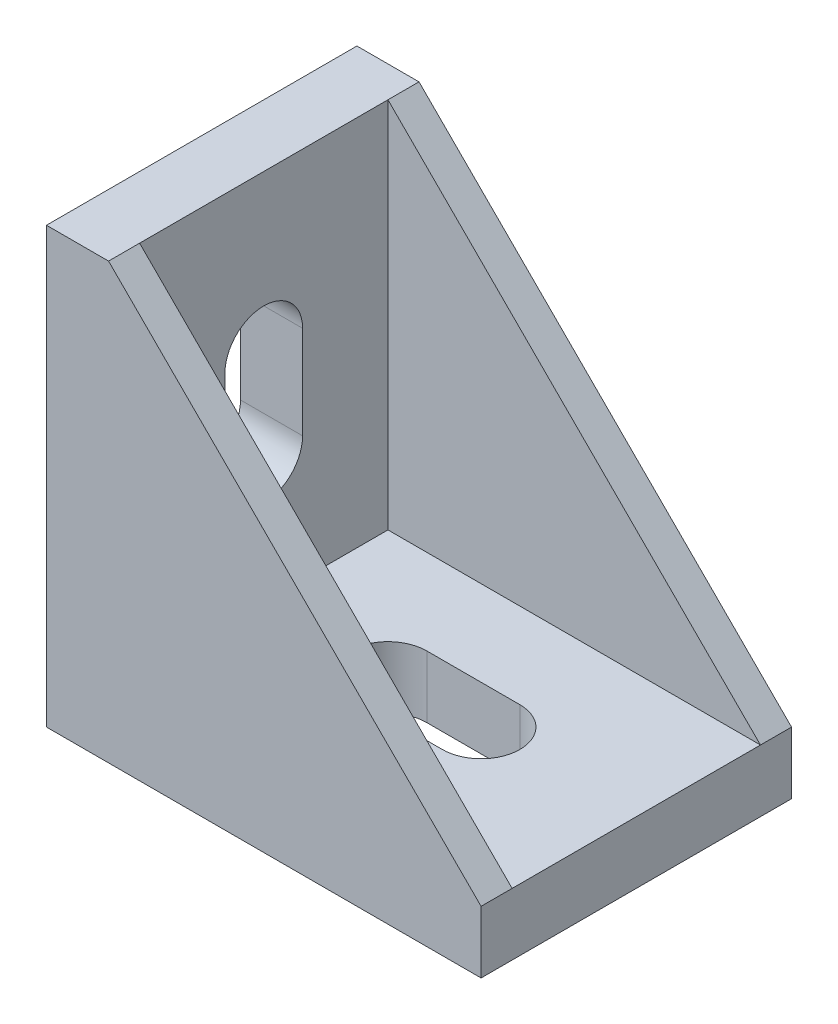
ISO-10303-21;
HEADER;
FILE_DESCRIPTION(('STEP AP214'),'2;1');
FILE_NAME('part.step','',(''),(''),'','','');
FILE_SCHEMA(('AUTOMOTIVE_DESIGN { 1 0 10303 214 1 1 1 1 }'));
ENDSEC;
DATA;
#1=APPLICATION_CONTEXT('core data for automotive mechanical design processes');
#2=APPLICATION_PROTOCOL_DEFINITION('international standard','automotive_design',2000,#1);
#3=PRODUCT_CONTEXT('',#1,'mechanical');
#4=PRODUCT('Part','Part','',(#3));
#5=PRODUCT_RELATED_PRODUCT_CATEGORY('part','',(#4));
#6=PRODUCT_DEFINITION_FORMATION('','',#4);
#7=PRODUCT_DEFINITION_CONTEXT('part definition',#1,'design');
#8=PRODUCT_DEFINITION('design','',#6,#7);
#9=PRODUCT_DEFINITION_SHAPE('','',#8);
#10=(LENGTH_UNIT() NAMED_UNIT(*) SI_UNIT(.MILLI.,.METRE.));
#11=(NAMED_UNIT(*) PLANE_ANGLE_UNIT() SI_UNIT($,.RADIAN.));
#12=(NAMED_UNIT(*) SI_UNIT($,.STERADIAN.) SOLID_ANGLE_UNIT());
#13=UNCERTAINTY_MEASURE_WITH_UNIT(LENGTH_MEASURE(1.E-05),#10,'distance_accuracy_value','');
#14=(GEOMETRIC_REPRESENTATION_CONTEXT(3) GLOBAL_UNCERTAINTY_ASSIGNED_CONTEXT((#13)) GLOBAL_UNIT_ASSIGNED_CONTEXT((#10,
#11,#12)) REPRESENTATION_CONTEXT('',''));
#15=CARTESIAN_POINT('',(0.,0.,0.));
#16=DIRECTION('',(0.,0.,1.));
#17=DIRECTION('',(1.,0.,0.));
#18=AXIS2_PLACEMENT_3D('',#15,#16,#17);
#19=CARTESIAN_POINT('',(4.,28.,10.));
#20=DIRECTION('',(-1.,0.,0.));
#21=DIRECTION('',(0.,-1.,0.));
#22=AXIS2_PLACEMENT_3D('',#19,#20,#21);
#23=PLANE('',#22);
#24=DIRECTION('',(0.,-1.,0.));
#25=VECTOR('',#24,1.);
#26=CARTESIAN_POINT('',(4.,4.,-8.));
#27=LINE('',#26,#25);
#28=CARTESIAN_POINT('',(4.,28.,-8.));
#29=VERTEX_POINT('',#28);
#30=CARTESIAN_POINT('',(4.,4.,-8.));
#31=VERTEX_POINT('',#30);
#32=EDGE_CURVE('E443',#29,#31,#27,.T.);
#33=ORIENTED_EDGE('',*,*,#32,.F.);
#34=DIRECTION('',(0.,0.,-1.));
#35=VECTOR('',#34,1.);
#36=CARTESIAN_POINT('',(4.,28.,10.));
#37=LINE('',#36,#35);
#38=CARTESIAN_POINT('',(4.,28.,8.));
#39=VERTEX_POINT('',#38);
#40=EDGE_CURVE('E483',#39,#29,#37,.T.);
#41=ORIENTED_EDGE('',*,*,#40,.F.);
#42=DIRECTION('',(0.,-1.,0.));
#43=VECTOR('',#42,1.);
#44=CARTESIAN_POINT('',(4.,4.,8.));
#45=LINE('',#44,#43);
#46=CARTESIAN_POINT('',(4.,4.,8.));
#47=VERTEX_POINT('',#46);
#48=EDGE_CURVE('E460',#39,#47,#45,.T.);
#49=ORIENTED_EDGE('',*,*,#48,.T.);
#50=DIRECTION('',(0.,0.,-1.));
#51=VECTOR('',#50,1.);
#52=CARTESIAN_POINT('',(4.,4.,10.));
#53=LINE('',#52,#51);
#54=EDGE_CURVE('E494',#47,#31,#53,.T.);
#55=ORIENTED_EDGE('',*,*,#54,.T.);
#56=EDGE_LOOP('',(#33,#41,#49,#55));
#57=FACE_BOUND('',#56,.T.);
#58=CARTESIAN_POINT('',(4.,12.,0.));
#59=DIRECTION('',(-1.,0.,0.));
#60=DIRECTION('',(0.,0.,1.));
#61=AXIS2_PLACEMENT_3D('',#58,#59,#60);
#62=CIRCLE('',#61,2.5);
#63=CARTESIAN_POINT('',(4.,12.,-2.5));
#64=VERTEX_POINT('',#63);
#65=CARTESIAN_POINT('',(4.,12.,2.5));
#66=VERTEX_POINT('',#65);
#67=EDGE_CURVE('E313',#64,#66,#62,.T.);
#68=ORIENTED_EDGE('',*,*,#67,.T.);
#69=DIRECTION('',(0.,1.,0.));
#70=VECTOR('',#69,1.);
#71=CARTESIAN_POINT('',(4.,12.,2.5));
#72=LINE('',#71,#70);
#73=CARTESIAN_POINT('',(4.,18.,2.5));
#74=VERTEX_POINT('',#73);
#75=EDGE_CURVE('E317',#66,#74,#72,.T.);
#76=ORIENTED_EDGE('',*,*,#75,.T.);
#77=CARTESIAN_POINT('',(4.,18.,0.));
#78=DIRECTION('',(-1.,0.,0.));
#79=DIRECTION('',(0.,0.,1.));
#80=AXIS2_PLACEMENT_3D('',#77,#78,#79);
#81=CIRCLE('',#80,2.5);
#82=CARTESIAN_POINT('',(4.,18.,-2.5));
#83=VERTEX_POINT('',#82);
#84=EDGE_CURVE('E330',#74,#83,#81,.T.);
#85=ORIENTED_EDGE('',*,*,#84,.T.);
#86=DIRECTION('',(0.,-1.,0.));
#87=VECTOR('',#86,1.);
#88=CARTESIAN_POINT('',(4.,12.,-2.5));
#89=LINE('',#88,#87);
#90=EDGE_CURVE('E327',#83,#64,#89,.T.);
#91=ORIENTED_EDGE('',*,*,#90,.T.);
#92=EDGE_LOOP('',(#68,#76,#85,#91));
#93=FACE_BOUND('',#92,.T.);
#94=ADVANCED_FACE('F34',(#57,#93),#23,.F.);
#95=CARTESIAN_POINT('',(0.,28.,10.));
#96=DIRECTION('',(1.,0.,0.));
#97=DIRECTION('',(0.,0.,-1.));
#98=AXIS2_PLACEMENT_3D('',#95,#96,#97);
#99=PLANE('',#98);
#100=DIRECTION('',(0.,1.,0.));
#101=VECTOR('',#100,1.);
#102=CARTESIAN_POINT('',(0.,22.5,-3.));
#103=LINE('',#102,#101);
#104=CARTESIAN_POINT('',(0.,22.5,-3.));
#105=VERTEX_POINT('',#104);
#106=CARTESIAN_POINT('',(0.,25.,-3.));
#107=VERTEX_POINT('',#106);
#108=EDGE_CURVE('E275',#105,#107,#103,.T.);
#109=ORIENTED_EDGE('',*,*,#108,.T.);
#110=DIRECTION('',(0.,0.,1.));
#111=VECTOR('',#110,1.);
#112=CARTESIAN_POINT('',(0.,25.,-3.));
#113=LINE('',#112,#111);
#114=CARTESIAN_POINT('',(0.,25.,3.));
#115=VERTEX_POINT('',#114);
#116=EDGE_CURVE('E249',#107,#115,#113,.T.);
#117=ORIENTED_EDGE('',*,*,#116,.T.);
#118=DIRECTION('',(0.,-1.,0.));
#119=VECTOR('',#118,1.);
#120=CARTESIAN_POINT('',(0.,22.5,3.));
#121=LINE('',#120,#119);
#122=CARTESIAN_POINT('',(0.,22.5,3.));
#123=VERTEX_POINT('',#122);
#124=EDGE_CURVE('E265',#115,#123,#121,.T.);
#125=ORIENTED_EDGE('',*,*,#124,.T.);
#126=DIRECTION('',(0.,0.,-1.));
#127=VECTOR('',#126,1.);
#128=CARTESIAN_POINT('',(0.,22.5,-3.));
#129=LINE('',#128,#127);
#130=EDGE_CURVE('E49',#123,#105,#129,.T.);
#131=ORIENTED_EDGE('',*,*,#130,.T.);
#132=EDGE_LOOP('',(#109,#117,#125,#131));
#133=FACE_BOUND('',#132,.T.);
#134=DIRECTION('',(0.,1.,0.));
#135=VECTOR('',#134,1.);
#136=CARTESIAN_POINT('',(0.,3.,-3.));
#137=LINE('',#136,#135);
#138=CARTESIAN_POINT('',(0.,3.,-3.));
#139=VERTEX_POINT('',#138);
#140=CARTESIAN_POINT('',(0.,5.5,-3.));
#141=VERTEX_POINT('',#140);
#142=EDGE_CURVE('E300',#139,#141,#137,.T.);
#143=ORIENTED_EDGE('',*,*,#142,.T.);
#144=DIRECTION('',(0.,0.,1.));
#145=VECTOR('',#144,1.);
#146=CARTESIAN_POINT('',(0.,5.5,-3.));
#147=LINE('',#146,#145);
#148=CARTESIAN_POINT('',(0.,5.5,3.));
#149=VERTEX_POINT('',#148);
#150=EDGE_CURVE('E254',#141,#149,#147,.T.);
#151=ORIENTED_EDGE('',*,*,#150,.T.);
#152=DIRECTION('',(0.,-1.,0.));
#153=VECTOR('',#152,1.);
#154=CARTESIAN_POINT('',(0.,3.,3.));
#155=LINE('',#154,#153);
#156=CARTESIAN_POINT('',(0.,3.,3.));
#157=VERTEX_POINT('',#156);
#158=EDGE_CURVE('E288',#149,#157,#155,.T.);
#159=ORIENTED_EDGE('',*,*,#158,.T.);
#160=DIRECTION('',(0.,0.,-1.));
#161=VECTOR('',#160,1.);
#162=CARTESIAN_POINT('',(0.,3.,-3.));
#163=LINE('',#162,#161);
#164=EDGE_CURVE('E57',#157,#139,#163,.T.);
#165=ORIENTED_EDGE('',*,*,#164,.T.);
#166=EDGE_LOOP('',(#143,#151,#159,#165));
#167=FACE_BOUND('',#166,.T.);
#168=DIRECTION('',(0.,-1.,0.));
#169=VECTOR('',#168,1.);
#170=CARTESIAN_POINT('',(0.,28.,-10.));
#171=LINE('',#170,#169);
#172=CARTESIAN_POINT('',(0.,28.,-10.));
#173=VERTEX_POINT('',#172);
#174=CARTESIAN_POINT('',(0.,0.,-10.));
#175=VERTEX_POINT('',#174);
#176=EDGE_CURVE('E486',#173,#175,#171,.T.);
#177=ORIENTED_EDGE('',*,*,#176,.T.);
#178=DIRECTION('',(0.,0.,-1.));
#179=VECTOR('',#178,1.);
#180=CARTESIAN_POINT('',(0.,0.,10.));
#181=LINE('',#180,#179);
#182=CARTESIAN_POINT('',(0.,0.,10.));
#183=VERTEX_POINT('',#182);
#184=EDGE_CURVE('E42',#183,#175,#181,.T.);
#185=ORIENTED_EDGE('',*,*,#184,.F.);
#186=DIRECTION('',(0.,-1.,0.));
#187=VECTOR('',#186,1.);
#188=CARTESIAN_POINT('',(0.,28.,10.));
#189=LINE('',#188,#187);
#190=CARTESIAN_POINT('',(0.,28.,10.));
#191=VERTEX_POINT('',#190);
#192=EDGE_CURVE('E475',#191,#183,#189,.T.);
#193=ORIENTED_EDGE('',*,*,#192,.F.);
#194=DIRECTION('',(0.,0.,-1.));
#195=VECTOR('',#194,1.);
#196=CARTESIAN_POINT('',(0.,28.,10.));
#197=LINE('',#196,#195);
#198=EDGE_CURVE('E11',#191,#173,#197,.T.);
#199=ORIENTED_EDGE('',*,*,#198,.T.);
#200=EDGE_LOOP('',(#177,#185,#193,#199));
#201=FACE_BOUND('',#200,.T.);
#202=CARTESIAN_POINT('',(0.,12.,0.));
#203=DIRECTION('',(-1.,0.,0.));
#204=DIRECTION('',(0.,0.,1.));
#205=AXIS2_PLACEMENT_3D('',#202,#203,#204);
#206=CIRCLE('',#205,2.5);
#207=CARTESIAN_POINT('',(0.,12.,-2.5));
#208=VERTEX_POINT('',#207);
#209=CARTESIAN_POINT('',(0.,12.,2.5));
#210=VERTEX_POINT('',#209);
#211=EDGE_CURVE('E314',#208,#210,#206,.T.);
#212=ORIENTED_EDGE('',*,*,#211,.F.);
#213=DIRECTION('',(0.,-1.,0.));
#214=VECTOR('',#213,1.);
#215=CARTESIAN_POINT('',(0.,12.,-2.5));
#216=LINE('',#215,#214);
#217=CARTESIAN_POINT('',(0.,18.,-2.5));
#218=VERTEX_POINT('',#217);
#219=EDGE_CURVE('E316',#218,#208,#216,.T.);
#220=ORIENTED_EDGE('',*,*,#219,.F.);
#221=CARTESIAN_POINT('',(0.,18.,0.));
#222=DIRECTION('',(-1.,0.,0.));
#223=DIRECTION('',(0.,0.,1.));
#224=AXIS2_PLACEMENT_3D('',#221,#222,#223);
#225=CIRCLE('',#224,2.5);
#226=CARTESIAN_POINT('',(0.,18.,2.5));
#227=VERTEX_POINT('',#226);
#228=EDGE_CURVE('E319',#227,#218,#225,.T.);
#229=ORIENTED_EDGE('',*,*,#228,.F.);
#230=DIRECTION('',(0.,1.,0.));
#231=VECTOR('',#230,1.);
#232=CARTESIAN_POINT('',(0.,12.,2.5));
#233=LINE('',#232,#231);
#234=EDGE_CURVE('E322',#210,#227,#233,.T.);
#235=ORIENTED_EDGE('',*,*,#234,.F.);
#236=EDGE_LOOP('',(#212,#220,#229,#235));
#237=FACE_BOUND('',#236,.T.);
#238=ADVANCED_FACE('F544',(#133,#167,#201,#237),#99,.F.);
#239=CARTESIAN_POINT('',(0.,0.,10.));
#240=DIRECTION('',(0.,1.,0.));
#241=DIRECTION('',(0.,0.,1.));
#242=AXIS2_PLACEMENT_3D('',#239,#240,#241);
#243=PLANE('',#242);
#244=DIRECTION('',(0.,0.,1.));
#245=VECTOR('',#244,1.);
#246=CARTESIAN_POINT('',(5.5,0.,-3.));
#247=LINE('',#246,#245);
#248=CARTESIAN_POINT('',(5.5,0.,-3.));
#249=VERTEX_POINT('',#248);
#250=CARTESIAN_POINT('',(5.5,0.,3.));
#251=VERTEX_POINT('',#250);
#252=EDGE_CURVE('E377',#249,#251,#247,.T.);
#253=ORIENTED_EDGE('',*,*,#252,.F.);
#254=DIRECTION('',(1.,0.,0.));
#255=VECTOR('',#254,1.);
#256=CARTESIAN_POINT('',(3.,0.,-3.));
#257=LINE('',#256,#255);
#258=CARTESIAN_POINT('',(3.,0.,-3.));
#259=VERTEX_POINT('',#258);
#260=EDGE_CURVE('E382',#259,#249,#257,.T.);
#261=ORIENTED_EDGE('',*,*,#260,.F.);
#262=DIRECTION('',(0.,0.,-1.));
#263=VECTOR('',#262,1.);
#264=CARTESIAN_POINT('',(3.,0.,-3.));
#265=LINE('',#264,#263);
#266=CARTESIAN_POINT('',(3.,0.,3.));
#267=VERTEX_POINT('',#266);
#268=EDGE_CURVE('E394',#267,#259,#265,.T.);
#269=ORIENTED_EDGE('',*,*,#268,.F.);
#270=DIRECTION('',(-1.,0.,0.));
#271=VECTOR('',#270,1.);
#272=CARTESIAN_POINT('',(3.,0.,3.));
#273=LINE('',#272,#271);
#274=EDGE_CURVE('E391',#251,#267,#273,.T.);
#275=ORIENTED_EDGE('',*,*,#274,.F.);
#276=EDGE_LOOP('',(#253,#261,#269,#275));
#277=FACE_BOUND('',#276,.T.);
#278=DIRECTION('',(-1.,0.,0.));
#279=VECTOR('',#278,1.);
#280=CARTESIAN_POINT('',(12.,0.,-2.5));
#281=LINE('',#280,#279);
#282=CARTESIAN_POINT('',(18.,0.,-2.5));
#283=VERTEX_POINT('',#282);
#284=CARTESIAN_POINT('',(12.,0.,-2.5));
#285=VERTEX_POINT('',#284);
#286=EDGE_CURVE('E421',#283,#285,#281,.T.);
#287=ORIENTED_EDGE('',*,*,#286,.T.);
#288=CARTESIAN_POINT('',(12.,0.,0.));
#289=DIRECTION('',(0.,1.,0.));
#290=DIRECTION('',(0.,0.,1.));
#291=AXIS2_PLACEMENT_3D('',#288,#289,#290);
#292=CIRCLE('',#291,2.5);
#293=CARTESIAN_POINT('',(12.,0.,2.5));
#294=VERTEX_POINT('',#293);
#295=EDGE_CURVE('E411',#285,#294,#292,.T.);
#296=ORIENTED_EDGE('',*,*,#295,.T.);
#297=DIRECTION('',(1.,0.,0.));
#298=VECTOR('',#297,1.);
#299=CARTESIAN_POINT('',(12.,0.,2.5));
#300=LINE('',#299,#298);
#301=CARTESIAN_POINT('',(18.,0.,2.5));
#302=VERTEX_POINT('',#301);
#303=EDGE_CURVE('E414',#294,#302,#300,.T.);
#304=ORIENTED_EDGE('',*,*,#303,.T.);
#305=CARTESIAN_POINT('',(18.,0.,0.));
#306=DIRECTION('',(0.,1.,0.));
#307=DIRECTION('',(0.,0.,1.));
#308=AXIS2_PLACEMENT_3D('',#305,#306,#307);
#309=CIRCLE('',#308,2.5);
#310=EDGE_CURVE('E418',#302,#283,#309,.T.);
#311=ORIENTED_EDGE('',*,*,#310,.T.);
#312=EDGE_LOOP('',(#287,#296,#304,#311));
#313=FACE_BOUND('',#312,.T.);
#314=DIRECTION('',(1.,0.,0.));
#315=VECTOR('',#314,1.);
#316=CARTESIAN_POINT('',(0.,0.,-10.));
#317=LINE('',#316,#315);
#318=CARTESIAN_POINT('',(28.,0.,-10.));
#319=VERTEX_POINT('',#318);
#320=EDGE_CURVE('E488',#175,#319,#317,.T.);
#321=ORIENTED_EDGE('',*,*,#320,.T.);
#322=DIRECTION('',(0.,0.,-1.));
#323=VECTOR('',#322,1.);
#324=CARTESIAN_POINT('',(28.,0.,10.));
#325=LINE('',#324,#323);
#326=CARTESIAN_POINT('',(28.,0.,10.));
#327=VERTEX_POINT('',#326);
#328=EDGE_CURVE('E500',#327,#319,#325,.T.);
#329=ORIENTED_EDGE('',*,*,#328,.F.);
#330=DIRECTION('',(1.,0.,0.));
#331=VECTOR('',#330,1.);
#332=CARTESIAN_POINT('',(0.,0.,10.));
#333=LINE('',#332,#331);
#334=EDGE_CURVE('E478',#183,#327,#333,.T.);
#335=ORIENTED_EDGE('',*,*,#334,.F.);
#336=ORIENTED_EDGE('',*,*,#184,.T.);
#337=EDGE_LOOP('',(#321,#329,#335,#336));
#338=FACE_BOUND('',#337,.T.);
#339=DIRECTION('',(0.,0.,1.));
#340=VECTOR('',#339,1.);
#341=CARTESIAN_POINT('',(25.,0.,-3.));
#342=LINE('',#341,#340);
#343=CARTESIAN_POINT('',(25.,0.,-3.));
#344=VERTEX_POINT('',#343);
#345=CARTESIAN_POINT('',(25.,0.,3.));
#346=VERTEX_POINT('',#345);
#347=EDGE_CURVE('E338',#344,#346,#342,.T.);
#348=ORIENTED_EDGE('',*,*,#347,.F.);
#349=DIRECTION('',(1.,0.,0.));
#350=VECTOR('',#349,1.);
#351=CARTESIAN_POINT('',(22.5,0.,-3.));
#352=LINE('',#351,#350);
#353=CARTESIAN_POINT('',(22.5,0.,-3.));
#354=VERTEX_POINT('',#353);
#355=EDGE_CURVE('E349',#354,#344,#352,.T.);
#356=ORIENTED_EDGE('',*,*,#355,.F.);
#357=DIRECTION('',(0.,0.,-1.));
#358=VECTOR('',#357,1.);
#359=CARTESIAN_POINT('',(22.5,0.,-3.));
#360=LINE('',#359,#358);
#361=CARTESIAN_POINT('',(22.5,0.,3.));
#362=VERTEX_POINT('',#361);
#363=EDGE_CURVE('E361',#362,#354,#360,.T.);
#364=ORIENTED_EDGE('',*,*,#363,.F.);
#365=DIRECTION('',(-1.,0.,0.));
#366=VECTOR('',#365,1.);
#367=CARTESIAN_POINT('',(22.5,0.,3.));
#368=LINE('',#367,#366);
#369=EDGE_CURVE('E358',#346,#362,#368,.T.);
#370=ORIENTED_EDGE('',*,*,#369,.F.);
#371=EDGE_LOOP('',(#348,#356,#364,#370));
#372=FACE_BOUND('',#371,.T.);
#373=ADVANCED_FACE('F507',(#277,#313,#338,#372),#243,.F.);
#374=CARTESIAN_POINT('',(4.,4.,10.));
#375=DIRECTION('',(0.,-1.,0.));
#376=DIRECTION('',(0.,0.,-1.));
#377=AXIS2_PLACEMENT_3D('',#374,#375,#376);
#378=PLANE('',#377);
#379=DIRECTION('',(1.,0.,0.));
#380=VECTOR('',#379,1.);
#381=CARTESIAN_POINT('',(12.,4.,2.5));
#382=LINE('',#381,#380);
#383=CARTESIAN_POINT('',(12.,4.,2.5));
#384=VERTEX_POINT('',#383);
#385=CARTESIAN_POINT('',(18.,4.,2.5));
#386=VERTEX_POINT('',#385);
#387=EDGE_CURVE('E426',#384,#386,#382,.T.);
#388=ORIENTED_EDGE('',*,*,#387,.F.);
#389=CARTESIAN_POINT('',(12.,4.,0.));
#390=DIRECTION('',(0.,1.,0.));
#391=DIRECTION('',(0.,0.,1.));
#392=AXIS2_PLACEMENT_3D('',#389,#390,#391);
#393=CIRCLE('',#392,2.5);
#394=CARTESIAN_POINT('',(12.,4.,-2.5));
#395=VERTEX_POINT('',#394);
#396=EDGE_CURVE('E410',#395,#384,#393,.T.);
#397=ORIENTED_EDGE('',*,*,#396,.F.);
#398=DIRECTION('',(-1.,0.,0.));
#399=VECTOR('',#398,1.);
#400=CARTESIAN_POINT('',(12.,4.,-2.5));
#401=LINE('',#400,#399);
#402=CARTESIAN_POINT('',(18.,4.,-2.5));
#403=VERTEX_POINT('',#402);
#404=EDGE_CURVE('E415',#403,#395,#401,.T.);
#405=ORIENTED_EDGE('',*,*,#404,.F.);
#406=CARTESIAN_POINT('',(18.,4.,0.));
#407=DIRECTION('',(0.,1.,0.));
#408=DIRECTION('',(0.,0.,1.));
#409=AXIS2_PLACEMENT_3D('',#406,#407,#408);
#410=CIRCLE('',#409,2.5);
#411=EDGE_CURVE('E429',#386,#403,#410,.T.);
#412=ORIENTED_EDGE('',*,*,#411,.F.);
#413=EDGE_LOOP('',(#388,#397,#405,#412));
#414=FACE_BOUND('',#413,.T.);
#415=DIRECTION('',(1.,0.,0.));
#416=VECTOR('',#415,1.);
#417=CARTESIAN_POINT('',(28.,4.,-8.));
#418=LINE('',#417,#416);
#419=CARTESIAN_POINT('',(28.,4.,-8.));
#420=VERTEX_POINT('',#419);
#421=EDGE_CURVE('E449',#31,#420,#418,.T.);
#422=ORIENTED_EDGE('',*,*,#421,.F.);
#423=ORIENTED_EDGE('',*,*,#54,.F.);
#424=DIRECTION('',(1.,0.,0.));
#425=VECTOR('',#424,1.);
#426=CARTESIAN_POINT('',(28.,4.,8.));
#427=LINE('',#426,#425);
#428=CARTESIAN_POINT('',(28.,4.,8.));
#429=VERTEX_POINT('',#428);
#430=EDGE_CURVE('E463',#47,#429,#427,.T.);
#431=ORIENTED_EDGE('',*,*,#430,.T.);
#432=DIRECTION('',(0.,0.,-1.));
#433=VECTOR('',#432,1.);
#434=CARTESIAN_POINT('',(28.,4.,10.));
#435=LINE('',#434,#433);
#436=EDGE_CURVE('E497',#429,#420,#435,.T.);
#437=ORIENTED_EDGE('',*,*,#436,.T.);
#438=EDGE_LOOP('',(#422,#423,#431,#437));
#439=FACE_BOUND('',#438,.T.);
#440=ADVANCED_FACE('F529',(#414,#439),#378,.F.);
#441=CARTESIAN_POINT('',(4.,28.,10.));
#442=DIRECTION('',(0.,-1.,0.));
#443=DIRECTION('',(0.,0.,-1.));
#444=AXIS2_PLACEMENT_3D('',#441,#442,#443);
#445=PLANE('',#444);
#446=DIRECTION('',(-1.,0.,0.));
#447=VECTOR('',#446,1.);
#448=CARTESIAN_POINT('',(4.,28.,-10.));
#449=LINE('',#448,#447);
#450=CARTESIAN_POINT('',(4.,28.,-10.));
#451=VERTEX_POINT('',#450);
#452=EDGE_CURVE('E469',#451,#173,#449,.T.);
#453=ORIENTED_EDGE('',*,*,#452,.T.);
#454=ORIENTED_EDGE('',*,*,#198,.F.);
#455=DIRECTION('',(-1.,0.,0.));
#456=VECTOR('',#455,1.);
#457=CARTESIAN_POINT('',(4.,28.,10.));
#458=LINE('',#457,#456);
#459=CARTESIAN_POINT('',(4.,28.,10.));
#460=VERTEX_POINT('',#459);
#461=EDGE_CURVE('E472',#460,#191,#458,.T.);
#462=ORIENTED_EDGE('',*,*,#461,.F.);
#463=EDGE_CURVE('E491',#460,#39,#37,.T.);
#464=ORIENTED_EDGE('',*,*,#463,.T.);
#465=ORIENTED_EDGE('',*,*,#40,.T.);
#466=DIRECTION('',(0.,0.,-1.));
#467=VECTOR('',#466,1.);
#468=CARTESIAN_POINT('',(4.,28.,-8.));
#469=LINE('',#468,#467);
#470=EDGE_CURVE('E452',#29,#451,#469,.T.);
#471=ORIENTED_EDGE('',*,*,#470,.T.);
#472=EDGE_LOOP('',(#453,#454,#462,#464,#465,#471));
#473=FACE_BOUND('',#472,.T.);
#474=ADVANCED_FACE('F36',(#473),#445,.F.);
#475=CARTESIAN_POINT('',(28.,0.,10.));
#476=DIRECTION('',(-1.,0.,0.));
#477=DIRECTION('',(0.,0.,1.));
#478=AXIS2_PLACEMENT_3D('',#475,#476,#477);
#479=PLANE('',#478);
#480=DIRECTION('',(0.,1.,0.));
#481=VECTOR('',#480,1.);
#482=CARTESIAN_POINT('',(28.,0.,-10.));
#483=LINE('',#482,#481);
#484=CARTESIAN_POINT('',(28.,4.,-10.));
#485=VERTEX_POINT('',#484);
#486=EDGE_CURVE('E476',#319,#485,#483,.T.);
#487=ORIENTED_EDGE('',*,*,#486,.T.);
#488=DIRECTION('',(0.,0.,-1.));
#489=VECTOR('',#488,1.);
#490=CARTESIAN_POINT('',(28.,4.,-8.));
#491=LINE('',#490,#489);
#492=EDGE_CURVE('E455',#420,#485,#491,.T.);
#493=ORIENTED_EDGE('',*,*,#492,.F.);
#494=ORIENTED_EDGE('',*,*,#436,.F.);
#495=CARTESIAN_POINT('',(28.,4.,10.));
#496=VERTEX_POINT('',#495);
#497=EDGE_CURVE('E498',#496,#429,#435,.T.);
#498=ORIENTED_EDGE('',*,*,#497,.F.);
#499=DIRECTION('',(0.,1.,0.));
#500=VECTOR('',#499,1.);
#501=CARTESIAN_POINT('',(28.,0.,10.));
#502=LINE('',#501,#500);
#503=EDGE_CURVE('E480',#327,#496,#502,.T.);
#504=ORIENTED_EDGE('',*,*,#503,.F.);
#505=ORIENTED_EDGE('',*,*,#328,.T.);
#506=EDGE_LOOP('',(#487,#493,#494,#498,#504,#505));
#507=FACE_BOUND('',#506,.T.);
#508=ADVANCED_FACE('F517',(#507),#479,.F.);
#509=CARTESIAN_POINT('',(0.,0.,10.));
#510=DIRECTION('',(0.,0.,1.));
#511=DIRECTION('',(1.,0.,0.));
#512=AXIS2_PLACEMENT_3D('',#509,#510,#511);
#513=PLANE('',#512);
#514=DIRECTION('',(-0.707106781186548,0.707106781186548,0.));
#515=VECTOR('',#514,1.);
#516=CARTESIAN_POINT('',(4.,28.,10.));
#517=LINE('',#516,#515);
#518=EDGE_CURVE('E458',#496,#460,#517,.T.);
#519=ORIENTED_EDGE('',*,*,#518,.T.);
#520=ORIENTED_EDGE('',*,*,#461,.T.);
#521=ORIENTED_EDGE('',*,*,#192,.T.);
#522=ORIENTED_EDGE('',*,*,#334,.T.);
#523=ORIENTED_EDGE('',*,*,#503,.T.);
#524=EDGE_LOOP('',(#519,#520,#521,#522,#523));
#525=FACE_BOUND('',#524,.T.);
#526=ADVANCED_FACE('F541',(#525),#513,.T.);
#527=CARTESIAN_POINT('',(0.,0.,-10.));
#528=DIRECTION('',(0.,0.,1.));
#529=DIRECTION('',(1.,0.,0.));
#530=AXIS2_PLACEMENT_3D('',#527,#528,#529);
#531=PLANE('',#530);
#532=ORIENTED_EDGE('',*,*,#452,.F.);
#533=DIRECTION('',(-0.707106781186548,0.707106781186548,0.));
#534=VECTOR('',#533,1.);
#535=CARTESIAN_POINT('',(4.,28.,-10.));
#536=LINE('',#535,#534);
#537=EDGE_CURVE('E436',#485,#451,#536,.T.);
#538=ORIENTED_EDGE('',*,*,#537,.F.);
#539=ORIENTED_EDGE('',*,*,#486,.F.);
#540=ORIENTED_EDGE('',*,*,#320,.F.);
#541=ORIENTED_EDGE('',*,*,#176,.F.);
#542=EDGE_LOOP('',(#532,#538,#539,#540,#541));
#543=FACE_BOUND('',#542,.T.);
#544=ADVANCED_FACE('F514',(#543),#531,.F.);
#545=CARTESIAN_POINT('',(4.,28.,8.));
#546=DIRECTION('',(0.707106781186547,0.707106781186547,0.));
#547=DIRECTION('',(-0.707106781186548,0.707106781186548,0.));
#548=AXIS2_PLACEMENT_3D('',#545,#546,#547);
#549=PLANE('',#548);
#550=ORIENTED_EDGE('',*,*,#518,.F.);
#551=ORIENTED_EDGE('',*,*,#497,.T.);
#552=DIRECTION('',(-0.707106781186548,0.707106781186548,0.));
#553=VECTOR('',#552,1.);
#554=CARTESIAN_POINT('',(4.,28.,8.));
#555=LINE('',#554,#553);
#556=EDGE_CURVE('E466',#429,#39,#555,.T.);
#557=ORIENTED_EDGE('',*,*,#556,.T.);
#558=ORIENTED_EDGE('',*,*,#463,.F.);
#559=EDGE_LOOP('',(#550,#551,#557,#558));
#560=FACE_BOUND('',#559,.T.);
#561=ADVANCED_FACE('F538',(#560),#549,.T.);
#562=CARTESIAN_POINT('',(0.,0.,8.));
#563=DIRECTION('',(0.,0.,1.));
#564=DIRECTION('',(1.,0.,0.));
#565=AXIS2_PLACEMENT_3D('',#562,#563,#564);
#566=PLANE('',#565);
#567=ORIENTED_EDGE('',*,*,#48,.F.);
#568=ORIENTED_EDGE('',*,*,#556,.F.);
#569=ORIENTED_EDGE('',*,*,#430,.F.);
#570=EDGE_LOOP('',(#567,#568,#569));
#571=FACE_BOUND('',#570,.T.);
#572=ADVANCED_FACE('F536',(#571),#566,.F.);
#573=CARTESIAN_POINT('',(4.,28.,-8.));
#574=DIRECTION('',(-0.707106781186547,-0.707106781186547,0.));
#575=DIRECTION('',(0.707106781186548,-0.707106781186548,0.));
#576=AXIS2_PLACEMENT_3D('',#573,#574,#575);
#577=PLANE('',#576);
#578=ORIENTED_EDGE('',*,*,#537,.T.);
#579=ORIENTED_EDGE('',*,*,#470,.F.);
#580=DIRECTION('',(-0.707106781186548,0.707106781186548,0.));
#581=VECTOR('',#580,1.);
#582=CARTESIAN_POINT('',(4.,28.,-8.));
#583=LINE('',#582,#581);
#584=EDGE_CURVE('E446',#420,#29,#583,.T.);
#585=ORIENTED_EDGE('',*,*,#584,.F.);
#586=ORIENTED_EDGE('',*,*,#492,.T.);
#587=EDGE_LOOP('',(#578,#579,#585,#586));
#588=FACE_BOUND('',#587,.T.);
#589=ADVANCED_FACE('F523',(#588),#577,.F.);
#590=CARTESIAN_POINT('',(0.,0.,-8.));
#591=DIRECTION('',(0.,0.,-1.));
#592=DIRECTION('',(1.,0.,0.));
#593=AXIS2_PLACEMENT_3D('',#590,#591,#592);
#594=PLANE('',#593);
#595=ORIENTED_EDGE('',*,*,#32,.T.);
#596=ORIENTED_EDGE('',*,*,#421,.T.);
#597=ORIENTED_EDGE('',*,*,#584,.T.);
#598=EDGE_LOOP('',(#595,#596,#597));
#599=FACE_BOUND('',#598,.T.);
#600=ADVANCED_FACE('F526',(#599),#594,.F.);
#601=CARTESIAN_POINT('',(12.,0.,0.));
#602=DIRECTION('',(0.,1.,0.));
#603=DIRECTION('',(0.,0.,1.));
#604=AXIS2_PLACEMENT_3D('',#601,#602,#603);
#605=CYLINDRICAL_SURFACE('',#604,2.5);
#606=ORIENTED_EDGE('',*,*,#396,.T.);
#607=DIRECTION('',(0.,1.,0.));
#608=VECTOR('',#607,1.);
#609=CARTESIAN_POINT('',(12.,0.,2.5));
#610=LINE('',#609,#608);
#611=EDGE_CURVE('E424',#294,#384,#610,.T.);
#612=ORIENTED_EDGE('',*,*,#611,.F.);
#613=ORIENTED_EDGE('',*,*,#295,.F.);
#614=DIRECTION('',(0.,1.,0.));
#615=VECTOR('',#614,1.);
#616=CARTESIAN_POINT('',(12.,0.,-2.5));
#617=LINE('',#616,#615);
#618=EDGE_CURVE('E434',#285,#395,#617,.T.);
#619=ORIENTED_EDGE('',*,*,#618,.T.);
#620=EDGE_LOOP('',(#606,#612,#613,#619));
#621=FACE_BOUND('',#620,.T.);
#622=ADVANCED_FACE('F576',(#621),#605,.F.);
#623=CARTESIAN_POINT('',(12.,0.,-2.5));
#624=DIRECTION('',(0.,0.,-1.));
#625=DIRECTION('',(-1.,0.,0.));
#626=AXIS2_PLACEMENT_3D('',#623,#624,#625);
#627=PLANE('',#626);
#628=ORIENTED_EDGE('',*,*,#404,.T.);
#629=ORIENTED_EDGE('',*,*,#618,.F.);
#630=ORIENTED_EDGE('',*,*,#286,.F.);
#631=DIRECTION('',(0.,1.,0.));
#632=VECTOR('',#631,1.);
#633=CARTESIAN_POINT('',(18.,0.,-2.5));
#634=LINE('',#633,#632);
#635=EDGE_CURVE('E437',#283,#403,#634,.T.);
#636=ORIENTED_EDGE('',*,*,#635,.T.);
#637=EDGE_LOOP('',(#628,#629,#630,#636));
#638=FACE_BOUND('',#637,.T.);
#639=ADVANCED_FACE('F572',(#638),#627,.F.);
#640=CARTESIAN_POINT('',(18.,0.,0.));
#641=DIRECTION('',(0.,1.,0.));
#642=DIRECTION('',(0.,0.,1.));
#643=AXIS2_PLACEMENT_3D('',#640,#641,#642);
#644=CYLINDRICAL_SURFACE('',#643,2.5);
#645=ORIENTED_EDGE('',*,*,#411,.T.);
#646=ORIENTED_EDGE('',*,*,#635,.F.);
#647=ORIENTED_EDGE('',*,*,#310,.F.);
#648=DIRECTION('',(0.,1.,0.));
#649=VECTOR('',#648,1.);
#650=CARTESIAN_POINT('',(18.,0.,2.5));
#651=LINE('',#650,#649);
#652=EDGE_CURVE('E439',#302,#386,#651,.T.);
#653=ORIENTED_EDGE('',*,*,#652,.T.);
#654=EDGE_LOOP('',(#645,#646,#647,#653));
#655=FACE_BOUND('',#654,.T.);
#656=ADVANCED_FACE('F584',(#655),#644,.F.);
#657=CARTESIAN_POINT('',(12.,0.,2.5));
#658=DIRECTION('',(0.,0.,1.));
#659=DIRECTION('',(1.,0.,0.));
#660=AXIS2_PLACEMENT_3D('',#657,#658,#659);
#661=PLANE('',#660);
#662=ORIENTED_EDGE('',*,*,#387,.T.);
#663=ORIENTED_EDGE('',*,*,#652,.F.);
#664=ORIENTED_EDGE('',*,*,#303,.F.);
#665=ORIENTED_EDGE('',*,*,#611,.T.);
#666=EDGE_LOOP('',(#662,#663,#664,#665));
#667=FACE_BOUND('',#666,.T.);
#668=ADVANCED_FACE('F581',(#667),#661,.F.);
#669=CARTESIAN_POINT('',(5.5,-2.5,-3.));
#670=DIRECTION('',(-1.,0.,0.));
#671=DIRECTION('',(0.,0.,1.));
#672=AXIS2_PLACEMENT_3D('',#669,#670,#671);
#673=PLANE('',#672);
#674=ORIENTED_EDGE('',*,*,#252,.T.);
#675=DIRECTION('',(0.,1.,0.));
#676=VECTOR('',#675,1.);
#677=CARTESIAN_POINT('',(5.5,-2.5,3.));
#678=LINE('',#677,#676);
#679=CARTESIAN_POINT('',(5.5,-2.5,3.));
#680=VERTEX_POINT('',#679);
#681=EDGE_CURVE('E407',#680,#251,#678,.T.);
#682=ORIENTED_EDGE('',*,*,#681,.F.);
#683=DIRECTION('',(0.,0.,1.));
#684=VECTOR('',#683,1.);
#685=CARTESIAN_POINT('',(5.5,-2.5,-3.));
#686=LINE('',#685,#684);
#687=CARTESIAN_POINT('',(5.5,-2.5,-3.));
#688=VERTEX_POINT('',#687);
#689=EDGE_CURVE('E378',#688,#680,#686,.T.);
#690=ORIENTED_EDGE('',*,*,#689,.F.);
#691=DIRECTION('',(0.,1.,0.));
#692=VECTOR('',#691,1.);
#693=CARTESIAN_POINT('',(5.5,-2.5,-3.));
#694=LINE('',#693,#692);
#695=EDGE_CURVE('E388',#688,#249,#694,.T.);
#696=ORIENTED_EDGE('',*,*,#695,.T.);
#697=EDGE_LOOP('',(#674,#682,#690,#696));
#698=FACE_BOUND('',#697,.T.);
#699=ADVANCED_FACE('F591',(#698),#673,.F.);
#700=CARTESIAN_POINT('',(3.,-2.5,3.));
#701=DIRECTION('',(0.,0.,-1.));
#702=DIRECTION('',(-1.,0.,0.));
#703=AXIS2_PLACEMENT_3D('',#700,#701,#702);
#704=PLANE('',#703);
#705=ORIENTED_EDGE('',*,*,#274,.T.);
#706=DIRECTION('',(0.,1.,0.));
#707=VECTOR('',#706,1.);
#708=CARTESIAN_POINT('',(3.,-2.5,3.));
#709=LINE('',#708,#707);
#710=CARTESIAN_POINT('',(3.,-2.5,3.));
#711=VERTEX_POINT('',#710);
#712=EDGE_CURVE('E404',#711,#267,#709,.T.);
#713=ORIENTED_EDGE('',*,*,#712,.F.);
#714=DIRECTION('',(-1.,0.,0.));
#715=VECTOR('',#714,1.);
#716=CARTESIAN_POINT('',(3.,-2.5,3.));
#717=LINE('',#716,#715);
#718=EDGE_CURVE('E381',#680,#711,#717,.T.);
#719=ORIENTED_EDGE('',*,*,#718,.F.);
#720=ORIENTED_EDGE('',*,*,#681,.T.);
#721=EDGE_LOOP('',(#705,#713,#719,#720));
#722=FACE_BOUND('',#721,.T.);
#723=ADVANCED_FACE('F660',(#722),#704,.F.);
#724=CARTESIAN_POINT('',(3.,-2.5,-3.));
#725=DIRECTION('',(1.,0.,0.));
#726=DIRECTION('',(0.,0.,-1.));
#727=AXIS2_PLACEMENT_3D('',#724,#725,#726);
#728=PLANE('',#727);
#729=ORIENTED_EDGE('',*,*,#268,.T.);
#730=DIRECTION('',(0.,1.,0.));
#731=VECTOR('',#730,1.);
#732=CARTESIAN_POINT('',(3.,-2.5,-3.));
#733=LINE('',#732,#731);
#734=CARTESIAN_POINT('',(3.,-2.5,-3.));
#735=VERTEX_POINT('',#734);
#736=EDGE_CURVE('E401',#735,#259,#733,.T.);
#737=ORIENTED_EDGE('',*,*,#736,.F.);
#738=DIRECTION('',(0.,0.,-1.));
#739=VECTOR('',#738,1.);
#740=CARTESIAN_POINT('',(3.,-2.5,-3.));
#741=LINE('',#740,#739);
#742=EDGE_CURVE('E384',#711,#735,#741,.T.);
#743=ORIENTED_EDGE('',*,*,#742,.F.);
#744=ORIENTED_EDGE('',*,*,#712,.T.);
#745=EDGE_LOOP('',(#729,#737,#743,#744));
#746=FACE_BOUND('',#745,.T.);
#747=ADVANCED_FACE('F669',(#746),#728,.F.);
#748=CARTESIAN_POINT('',(3.,-2.5,-3.));
#749=DIRECTION('',(0.,0.,1.));
#750=DIRECTION('',(1.,0.,0.));
#751=AXIS2_PLACEMENT_3D('',#748,#749,#750);
#752=PLANE('',#751);
#753=ORIENTED_EDGE('',*,*,#260,.T.);
#754=ORIENTED_EDGE('',*,*,#695,.F.);
#755=DIRECTION('',(1.,0.,0.));
#756=VECTOR('',#755,1.);
#757=CARTESIAN_POINT('',(3.,-2.5,-3.));
#758=LINE('',#757,#756);
#759=EDGE_CURVE('E386',#735,#688,#758,.T.);
#760=ORIENTED_EDGE('',*,*,#759,.F.);
#761=ORIENTED_EDGE('',*,*,#736,.T.);
#762=EDGE_LOOP('',(#753,#754,#760,#761));
#763=FACE_BOUND('',#762,.T.);
#764=ADVANCED_FACE('F679',(#763),#752,.F.);
#765=CARTESIAN_POINT('',(0.,-2.5,0.));
#766=DIRECTION('',(0.,1.,0.));
#767=DIRECTION('',(0.,0.,1.));
#768=AXIS2_PLACEMENT_3D('',#765,#766,#767);
#769=PLANE('',#768);
#770=ORIENTED_EDGE('',*,*,#689,.T.);
#771=ORIENTED_EDGE('',*,*,#718,.T.);
#772=ORIENTED_EDGE('',*,*,#742,.T.);
#773=ORIENTED_EDGE('',*,*,#759,.T.);
#774=EDGE_LOOP('',(#770,#771,#772,#773));
#775=FACE_BOUND('',#774,.T.);
#776=ADVANCED_FACE('F689',(#775),#769,.F.);
#777=CARTESIAN_POINT('',(25.,-2.5,-3.));
#778=DIRECTION('',(-1.,0.,0.));
#779=DIRECTION('',(0.,0.,1.));
#780=AXIS2_PLACEMENT_3D('',#777,#778,#779);
#781=PLANE('',#780);
#782=ORIENTED_EDGE('',*,*,#347,.T.);
#783=DIRECTION('',(0.,1.,0.));
#784=VECTOR('',#783,1.);
#785=CARTESIAN_POINT('',(25.,-2.5,3.));
#786=LINE('',#785,#784);
#787=CARTESIAN_POINT('',(25.,-2.5,3.));
#788=VERTEX_POINT('',#787);
#789=EDGE_CURVE('E374',#788,#346,#786,.T.);
#790=ORIENTED_EDGE('',*,*,#789,.F.);
#791=DIRECTION('',(0.,0.,1.));
#792=VECTOR('',#791,1.);
#793=CARTESIAN_POINT('',(25.,-2.5,-3.));
#794=LINE('',#793,#792);
#795=CARTESIAN_POINT('',(25.,-2.5,-3.));
#796=VERTEX_POINT('',#795);
#797=EDGE_CURVE('E345',#796,#788,#794,.T.);
#798=ORIENTED_EDGE('',*,*,#797,.F.);
#799=DIRECTION('',(0.,1.,0.));
#800=VECTOR('',#799,1.);
#801=CARTESIAN_POINT('',(25.,-2.5,-3.));
#802=LINE('',#801,#800);
#803=EDGE_CURVE('E355',#796,#344,#802,.T.);
#804=ORIENTED_EDGE('',*,*,#803,.T.);
#805=EDGE_LOOP('',(#782,#790,#798,#804));
#806=FACE_BOUND('',#805,.T.);
#807=ADVANCED_FACE('F699',(#806),#781,.F.);
#808=CARTESIAN_POINT('',(22.5,-2.5,3.));
#809=DIRECTION('',(0.,0.,-1.));
#810=DIRECTION('',(-1.,0.,0.));
#811=AXIS2_PLACEMENT_3D('',#808,#809,#810);
#812=PLANE('',#811);
#813=ORIENTED_EDGE('',*,*,#369,.T.);
#814=DIRECTION('',(0.,1.,0.));
#815=VECTOR('',#814,1.);
#816=CARTESIAN_POINT('',(22.5,-2.5,3.));
#817=LINE('',#816,#815);
#818=CARTESIAN_POINT('',(22.5,-2.5,3.));
#819=VERTEX_POINT('',#818);
#820=EDGE_CURVE('E371',#819,#362,#817,.T.);
#821=ORIENTED_EDGE('',*,*,#820,.F.);
#822=DIRECTION('',(-1.,0.,0.));
#823=VECTOR('',#822,1.);
#824=CARTESIAN_POINT('',(22.5,-2.5,3.));
#825=LINE('',#824,#823);
#826=EDGE_CURVE('E348',#788,#819,#825,.T.);
#827=ORIENTED_EDGE('',*,*,#826,.F.);
#828=ORIENTED_EDGE('',*,*,#789,.T.);
#829=EDGE_LOOP('',(#813,#821,#827,#828));
#830=FACE_BOUND('',#829,.T.);
#831=ADVANCED_FACE('F709',(#830),#812,.F.);
#832=CARTESIAN_POINT('',(22.5,-2.5,-3.));
#833=DIRECTION('',(1.,0.,0.));
#834=DIRECTION('',(0.,0.,-1.));
#835=AXIS2_PLACEMENT_3D('',#832,#833,#834);
#836=PLANE('',#835);
#837=ORIENTED_EDGE('',*,*,#363,.T.);
#838=DIRECTION('',(0.,1.,0.));
#839=VECTOR('',#838,1.);
#840=CARTESIAN_POINT('',(22.5,-2.5,-3.));
#841=LINE('',#840,#839);
#842=CARTESIAN_POINT('',(22.5,-2.5,-3.));
#843=VERTEX_POINT('',#842);
#844=EDGE_CURVE('E368',#843,#354,#841,.T.);
#845=ORIENTED_EDGE('',*,*,#844,.F.);
#846=DIRECTION('',(0.,0.,-1.));
#847=VECTOR('',#846,1.);
#848=CARTESIAN_POINT('',(22.5,-2.5,-3.));
#849=LINE('',#848,#847);
#850=EDGE_CURVE('E351',#819,#843,#849,.T.);
#851=ORIENTED_EDGE('',*,*,#850,.F.);
#852=ORIENTED_EDGE('',*,*,#820,.T.);
#853=EDGE_LOOP('',(#837,#845,#851,#852));
#854=FACE_BOUND('',#853,.T.);
#855=ADVANCED_FACE('F719',(#854),#836,.F.);
#856=CARTESIAN_POINT('',(22.5,-2.5,-3.));
#857=DIRECTION('',(0.,0.,1.));
#858=DIRECTION('',(1.,0.,0.));
#859=AXIS2_PLACEMENT_3D('',#856,#857,#858);
#860=PLANE('',#859);
#861=ORIENTED_EDGE('',*,*,#355,.T.);
#862=ORIENTED_EDGE('',*,*,#803,.F.);
#863=DIRECTION('',(1.,0.,0.));
#864=VECTOR('',#863,1.);
#865=CARTESIAN_POINT('',(22.5,-2.5,-3.));
#866=LINE('',#865,#864);
#867=EDGE_CURVE('E353',#843,#796,#866,.T.);
#868=ORIENTED_EDGE('',*,*,#867,.F.);
#869=ORIENTED_EDGE('',*,*,#844,.T.);
#870=EDGE_LOOP('',(#861,#862,#868,#869));
#871=FACE_BOUND('',#870,.T.);
#872=ADVANCED_FACE('F729',(#871),#860,.F.);
#873=CARTESIAN_POINT('',(0.,-2.5,0.));
#874=DIRECTION('',(0.,1.,0.));
#875=DIRECTION('',(0.,0.,1.));
#876=AXIS2_PLACEMENT_3D('',#873,#874,#875);
#877=PLANE('',#876);
#878=ORIENTED_EDGE('',*,*,#797,.T.);
#879=ORIENTED_EDGE('',*,*,#826,.T.);
#880=ORIENTED_EDGE('',*,*,#850,.T.);
#881=ORIENTED_EDGE('',*,*,#867,.T.);
#882=EDGE_LOOP('',(#878,#879,#880,#881));
#883=FACE_BOUND('',#882,.T.);
#884=ADVANCED_FACE('F739',(#883),#877,.F.);
#885=CARTESIAN_POINT('',(0.,12.,0.));
#886=DIRECTION('',(1.,0.,0.));
#887=DIRECTION('',(0.,1.,0.));
#888=AXIS2_PLACEMENT_3D('',#885,#886,#887);
#889=CYLINDRICAL_SURFACE('',#888,2.5);
#890=ORIENTED_EDGE('',*,*,#67,.F.);
#891=DIRECTION('',(1.,0.,0.));
#892=VECTOR('',#891,1.);
#893=CARTESIAN_POINT('',(0.,12.,-2.5));
#894=LINE('',#893,#892);
#895=EDGE_CURVE('E324',#208,#64,#894,.T.);
#896=ORIENTED_EDGE('',*,*,#895,.F.);
#897=ORIENTED_EDGE('',*,*,#211,.T.);
#898=DIRECTION('',(1.,0.,0.));
#899=VECTOR('',#898,1.);
#900=CARTESIAN_POINT('',(0.,12.,2.5));
#901=LINE('',#900,#899);
#902=EDGE_CURVE('E335',#210,#66,#901,.T.);
#903=ORIENTED_EDGE('',*,*,#902,.T.);
#904=EDGE_LOOP('',(#890,#896,#897,#903));
#905=FACE_BOUND('',#904,.T.);
#906=ADVANCED_FACE('F748',(#905),#889,.F.);
#907=CARTESIAN_POINT('',(0.,12.,2.5));
#908=DIRECTION('',(0.,0.,-1.));
#909=DIRECTION('',(-1.,0.,0.));
#910=AXIS2_PLACEMENT_3D('',#907,#908,#909);
#911=PLANE('',#910);
#912=ORIENTED_EDGE('',*,*,#75,.F.);
#913=ORIENTED_EDGE('',*,*,#902,.F.);
#914=ORIENTED_EDGE('',*,*,#234,.T.);
#915=DIRECTION('',(1.,0.,0.));
#916=VECTOR('',#915,1.);
#917=CARTESIAN_POINT('',(0.,18.,2.5));
#918=LINE('',#917,#916);
#919=EDGE_CURVE('E339',#227,#74,#918,.T.);
#920=ORIENTED_EDGE('',*,*,#919,.T.);
#921=EDGE_LOOP('',(#912,#913,#914,#920));
#922=FACE_BOUND('',#921,.T.);
#923=ADVANCED_FACE('F769',(#922),#911,.T.);
#924=CARTESIAN_POINT('',(0.,18.,0.));
#925=DIRECTION('',(1.,0.,0.));
#926=DIRECTION('',(0.,1.,0.));
#927=AXIS2_PLACEMENT_3D('',#924,#925,#926);
#928=CYLINDRICAL_SURFACE('',#927,2.5);
#929=ORIENTED_EDGE('',*,*,#84,.F.);
#930=ORIENTED_EDGE('',*,*,#919,.F.);
#931=ORIENTED_EDGE('',*,*,#228,.T.);
#932=DIRECTION('',(1.,0.,0.));
#933=VECTOR('',#932,1.);
#934=CARTESIAN_POINT('',(0.,18.,-2.5));
#935=LINE('',#934,#933);
#936=EDGE_CURVE('E341',#218,#83,#935,.T.);
#937=ORIENTED_EDGE('',*,*,#936,.T.);
#938=EDGE_LOOP('',(#929,#930,#931,#937));
#939=FACE_BOUND('',#938,.T.);
#940=ADVANCED_FACE('F779',(#939),#928,.F.);
#941=CARTESIAN_POINT('',(0.,12.,-2.5));
#942=DIRECTION('',(0.,0.,1.));
#943=DIRECTION('',(1.,0.,0.));
#944=AXIS2_PLACEMENT_3D('',#941,#942,#943);
#945=PLANE('',#944);
#946=ORIENTED_EDGE('',*,*,#90,.F.);
#947=ORIENTED_EDGE('',*,*,#936,.F.);
#948=ORIENTED_EDGE('',*,*,#219,.T.);
#949=ORIENTED_EDGE('',*,*,#895,.T.);
#950=EDGE_LOOP('',(#946,#947,#948,#949));
#951=FACE_BOUND('',#950,.T.);
#952=ADVANCED_FACE('F789',(#951),#945,.T.);
#953=CARTESIAN_POINT('',(-2.5,5.5,-3.));
#954=DIRECTION('',(0.,1.,0.));
#955=DIRECTION('',(-1.,0.,0.));
#956=AXIS2_PLACEMENT_3D('',#953,#954,#955);
#957=PLANE('',#956);
#958=ORIENTED_EDGE('',*,*,#150,.F.);
#959=DIRECTION('',(1.,0.,0.));
#960=VECTOR('',#959,1.);
#961=CARTESIAN_POINT('',(-2.5,5.5,-3.));
#962=LINE('',#961,#960);
#963=CARTESIAN_POINT('',(-2.5,5.5,-3.));
#964=VERTEX_POINT('',#963);
#965=EDGE_CURVE('E311',#964,#141,#962,.T.);
#966=ORIENTED_EDGE('',*,*,#965,.F.);
#967=DIRECTION('',(0.,0.,1.));
#968=VECTOR('',#967,1.);
#969=CARTESIAN_POINT('',(-2.5,5.5,-3.));
#970=LINE('',#969,#968);
#971=CARTESIAN_POINT('',(-2.5,5.5,3.));
#972=VERTEX_POINT('',#971);
#973=EDGE_CURVE('E284',#964,#972,#970,.T.);
#974=ORIENTED_EDGE('',*,*,#973,.T.);
#975=DIRECTION('',(1.,0.,0.));
#976=VECTOR('',#975,1.);
#977=CARTESIAN_POINT('',(-2.5,5.5,3.));
#978=LINE('',#977,#976);
#979=EDGE_CURVE('E297',#972,#149,#978,.T.);
#980=ORIENTED_EDGE('',*,*,#979,.T.);
#981=EDGE_LOOP('',(#958,#966,#974,#980));
#982=FACE_BOUND('',#981,.T.);
#983=ADVANCED_FACE('F799',(#982),#957,.T.);
#984=CARTESIAN_POINT('',(-2.5,3.,-3.));
#985=DIRECTION('',(0.,0.,-1.));
#986=DIRECTION('',(0.,1.,0.));
#987=AXIS2_PLACEMENT_3D('',#984,#985,#986);
#988=PLANE('',#987);
#989=ORIENTED_EDGE('',*,*,#142,.F.);
#990=DIRECTION('',(1.,0.,0.));
#991=VECTOR('',#990,1.);
#992=CARTESIAN_POINT('',(-2.5,3.,-3.));
#993=LINE('',#992,#991);
#994=CARTESIAN_POINT('',(-2.5,3.,-3.));
#995=VERTEX_POINT('',#994);
#996=EDGE_CURVE('E309',#995,#139,#993,.T.);
#997=ORIENTED_EDGE('',*,*,#996,.F.);
#998=DIRECTION('',(0.,1.,0.));
#999=VECTOR('',#998,1.);
#1000=CARTESIAN_POINT('',(-2.5,3.,-3.));
#1001=LINE('',#1000,#999);
#1002=EDGE_CURVE('E287',#995,#964,#1001,.T.);
#1003=ORIENTED_EDGE('',*,*,#1002,.T.);
#1004=ORIENTED_EDGE('',*,*,#965,.T.);
#1005=EDGE_LOOP('',(#989,#997,#1003,#1004));
#1006=FACE_BOUND('',#1005,.T.);
#1007=ADVANCED_FACE('F809',(#1006),#988,.T.);
#1008=CARTESIAN_POINT('',(-2.5,3.,-3.));
#1009=DIRECTION('',(0.,-1.,0.));
#1010=DIRECTION('',(1.,0.,0.));
#1011=AXIS2_PLACEMENT_3D('',#1008,#1009,#1010);
#1012=PLANE('',#1011);
#1013=ORIENTED_EDGE('',*,*,#164,.F.);
#1014=DIRECTION('',(1.,0.,0.));
#1015=VECTOR('',#1014,1.);
#1016=CARTESIAN_POINT('',(-2.5,3.,3.));
#1017=LINE('',#1016,#1015);
#1018=CARTESIAN_POINT('',(-2.5,3.,3.));
#1019=VERTEX_POINT('',#1018);
#1020=EDGE_CURVE('E307',#1019,#157,#1017,.T.);
#1021=ORIENTED_EDGE('',*,*,#1020,.F.);
#1022=DIRECTION('',(0.,0.,-1.));
#1023=VECTOR('',#1022,1.);
#1024=CARTESIAN_POINT('',(-2.5,3.,-3.));
#1025=LINE('',#1024,#1023);
#1026=EDGE_CURVE('E291',#1019,#995,#1025,.T.);
#1027=ORIENTED_EDGE('',*,*,#1026,.T.);
#1028=ORIENTED_EDGE('',*,*,#996,.T.);
#1029=EDGE_LOOP('',(#1013,#1021,#1027,#1028));
#1030=FACE_BOUND('',#1029,.T.);
#1031=ADVANCED_FACE('F819',(#1030),#1012,.T.);
#1032=CARTESIAN_POINT('',(-2.5,3.,3.));
#1033=DIRECTION('',(0.,0.,1.));
#1034=DIRECTION('',(1.,0.,0.));
#1035=AXIS2_PLACEMENT_3D('',#1032,#1033,#1034);
#1036=PLANE('',#1035);
#1037=ORIENTED_EDGE('',*,*,#158,.F.);
#1038=ORIENTED_EDGE('',*,*,#979,.F.);
#1039=DIRECTION('',(0.,-1.,0.));
#1040=VECTOR('',#1039,1.);
#1041=CARTESIAN_POINT('',(-2.5,3.,3.));
#1042=LINE('',#1041,#1040);
#1043=EDGE_CURVE('E294',#972,#1019,#1042,.T.);
#1044=ORIENTED_EDGE('',*,*,#1043,.T.);
#1045=ORIENTED_EDGE('',*,*,#1020,.T.);
#1046=EDGE_LOOP('',(#1037,#1038,#1044,#1045));
#1047=FACE_BOUND('',#1046,.T.);
#1048=ADVANCED_FACE('F829',(#1047),#1036,.T.);
#1049=CARTESIAN_POINT('',(-2.5,0.,0.));
#1050=DIRECTION('',(1.,0.,0.));
#1051=DIRECTION('',(0.,0.,1.));
#1052=AXIS2_PLACEMENT_3D('',#1049,#1050,#1051);
#1053=PLANE('',#1052);
#1054=ORIENTED_EDGE('',*,*,#973,.F.);
#1055=ORIENTED_EDGE('',*,*,#1002,.F.);
#1056=ORIENTED_EDGE('',*,*,#1026,.F.);
#1057=ORIENTED_EDGE('',*,*,#1043,.F.);
#1058=EDGE_LOOP('',(#1054,#1055,#1056,#1057));
#1059=FACE_BOUND('',#1058,.T.);
#1060=ADVANCED_FACE('F838',(#1059),#1053,.F.);
#1061=CARTESIAN_POINT('',(-2.49999999999999,25.,-3.));
#1062=DIRECTION('',(0.,1.,0.));
#1063=DIRECTION('',(-1.,0.,0.));
#1064=AXIS2_PLACEMENT_3D('',#1061,#1062,#1063);
#1065=PLANE('',#1064);
#1066=ORIENTED_EDGE('',*,*,#116,.F.);
#1067=DIRECTION('',(1.,0.,0.));
#1068=VECTOR('',#1067,1.);
#1069=CARTESIAN_POINT('',(-2.49999999999999,25.,-3.));
#1070=LINE('',#1069,#1068);
#1071=CARTESIAN_POINT('',(-2.49999999999999,25.,-3.));
#1072=VERTEX_POINT('',#1071);
#1073=EDGE_CURVE('E243',#1072,#107,#1070,.T.);
#1074=ORIENTED_EDGE('',*,*,#1073,.F.);
#1075=DIRECTION('',(0.,0.,1.));
#1076=VECTOR('',#1075,1.);
#1077=CARTESIAN_POINT('',(-2.49999999999999,25.,-3.));
#1078=LINE('',#1077,#1076);
#1079=CARTESIAN_POINT('',(-2.49999999999999,25.,3.));
#1080=VERTEX_POINT('',#1079);
#1081=EDGE_CURVE('E246',#1072,#1080,#1078,.T.);
#1082=ORIENTED_EDGE('',*,*,#1081,.T.);
#1083=DIRECTION('',(1.,0.,0.));
#1084=VECTOR('',#1083,1.);
#1085=CARTESIAN_POINT('',(-2.49999999999999,25.,3.));
#1086=LINE('',#1085,#1084);
#1087=EDGE_CURVE('E273',#1080,#115,#1086,.T.);
#1088=ORIENTED_EDGE('',*,*,#1087,.T.);
#1089=EDGE_LOOP('',(#1066,#1074,#1082,#1088));
#1090=FACE_BOUND('',#1089,.T.);
#1091=ADVANCED_FACE('F245',(#1090),#1065,.T.);
#1092=CARTESIAN_POINT('',(-2.49999999999999,22.5,-3.));
#1093=DIRECTION('',(0.,0.,-1.));
#1094=DIRECTION('',(-1.,0.,0.));
#1095=AXIS2_PLACEMENT_3D('',#1092,#1093,#1094);
#1096=PLANE('',#1095);
#1097=ORIENTED_EDGE('',*,*,#108,.F.);
#1098=DIRECTION('',(1.,0.,0.));
#1099=VECTOR('',#1098,1.);
#1100=CARTESIAN_POINT('',(-2.49999999999999,22.5,-3.));
#1101=LINE('',#1100,#1099);
#1102=CARTESIAN_POINT('',(-2.49999999999999,22.5,-3.));
#1103=VERTEX_POINT('',#1102);
#1104=EDGE_CURVE('E255',#1103,#105,#1101,.T.);
#1105=ORIENTED_EDGE('',*,*,#1104,.F.);
#1106=DIRECTION('',(0.,1.,0.));
#1107=VECTOR('',#1106,1.);
#1108=CARTESIAN_POINT('',(-2.49999999999999,22.5,-3.));
#1109=LINE('',#1108,#1107);
#1110=EDGE_CURVE('E261',#1103,#1072,#1109,.T.);
#1111=ORIENTED_EDGE('',*,*,#1110,.T.);
#1112=ORIENTED_EDGE('',*,*,#1073,.T.);
#1113=EDGE_LOOP('',(#1097,#1105,#1111,#1112));
#1114=FACE_BOUND('',#1113,.T.);
#1115=ADVANCED_FACE('F267',(#1114),#1096,.T.);
#1116=CARTESIAN_POINT('',(-2.49999999999999,22.5,-3.));
#1117=DIRECTION('',(0.,-1.,0.));
#1118=DIRECTION('',(1.,0.,0.));
#1119=AXIS2_PLACEMENT_3D('',#1116,#1117,#1118);
#1120=PLANE('',#1119);
#1121=ORIENTED_EDGE('',*,*,#130,.F.);
#1122=DIRECTION('',(1.,0.,0.));
#1123=VECTOR('',#1122,1.);
#1124=CARTESIAN_POINT('',(-2.49999999999999,22.5,3.));
#1125=LINE('',#1124,#1123);
#1126=CARTESIAN_POINT('',(-2.49999999999999,22.5,3.));
#1127=VERTEX_POINT('',#1126);
#1128=EDGE_CURVE('E281',#1127,#123,#1125,.T.);
#1129=ORIENTED_EDGE('',*,*,#1128,.F.);
#1130=DIRECTION('',(0.,0.,-1.));
#1131=VECTOR('',#1130,1.);
#1132=CARTESIAN_POINT('',(-2.49999999999999,22.5,-3.));
#1133=LINE('',#1132,#1131);
#1134=EDGE_CURVE('E268',#1127,#1103,#1133,.T.);
#1135=ORIENTED_EDGE('',*,*,#1134,.T.);
#1136=ORIENTED_EDGE('',*,*,#1104,.T.);
#1137=EDGE_LOOP('',(#1121,#1129,#1135,#1136));
#1138=FACE_BOUND('',#1137,.T.);
#1139=ADVANCED_FACE('F865',(#1138),#1120,.T.);
#1140=CARTESIAN_POINT('',(-2.49999999999999,22.5,3.));
#1141=DIRECTION('',(0.,0.,1.));
#1142=DIRECTION('',(1.,0.,0.));
#1143=AXIS2_PLACEMENT_3D('',#1140,#1141,#1142);
#1144=PLANE('',#1143);
#1145=ORIENTED_EDGE('',*,*,#124,.F.);
#1146=ORIENTED_EDGE('',*,*,#1087,.F.);
#1147=DIRECTION('',(0.,-1.,0.));
#1148=VECTOR('',#1147,1.);
#1149=CARTESIAN_POINT('',(-2.49999999999999,22.5,3.));
#1150=LINE('',#1149,#1148);
#1151=EDGE_CURVE('E264',#1080,#1127,#1150,.T.);
#1152=ORIENTED_EDGE('',*,*,#1151,.T.);
#1153=ORIENTED_EDGE('',*,*,#1128,.T.);
#1154=EDGE_LOOP('',(#1145,#1146,#1152,#1153));
#1155=FACE_BOUND('',#1154,.T.);
#1156=ADVANCED_FACE('F874',(#1155),#1144,.T.);
#1157=CARTESIAN_POINT('',(-2.5,0.,0.));
#1158=DIRECTION('',(1.,0.,0.));
#1159=DIRECTION('',(0.,0.,1.));
#1160=AXIS2_PLACEMENT_3D('',#1157,#1158,#1159);
#1161=PLANE('',#1160);
#1162=ORIENTED_EDGE('',*,*,#1081,.F.);
#1163=ORIENTED_EDGE('',*,*,#1110,.F.);
#1164=ORIENTED_EDGE('',*,*,#1134,.F.);
#1165=ORIENTED_EDGE('',*,*,#1151,.F.);
#1166=EDGE_LOOP('',(#1162,#1163,#1164,#1165));
#1167=FACE_BOUND('',#1166,.T.);
#1168=ADVANCED_FACE('F259',(#1167),#1161,.F.);
#1169=CLOSED_SHELL('',(#94,#238,#373,#440,#474,#508,#526,#544,#561,#572,#589,#600,#622,#639,
#656,#668,#699,#723,#747,#764,#776,#807,#831,#855,#872,#884,#906,#923,#940,#952,#983,#1007,
#1031,#1048,#1060,#1091,#1115,#1139,#1156,#1168));
#1170=MANIFOLD_SOLID_BREP('B2',#1169);
#1171=ADVANCED_BREP_SHAPE_REPRESENTATION('',(#18,#1170),#14);
#1172=SHAPE_DEFINITION_REPRESENTATION(#9,#1171);
ENDSEC;
END-ISO-10303-21;
